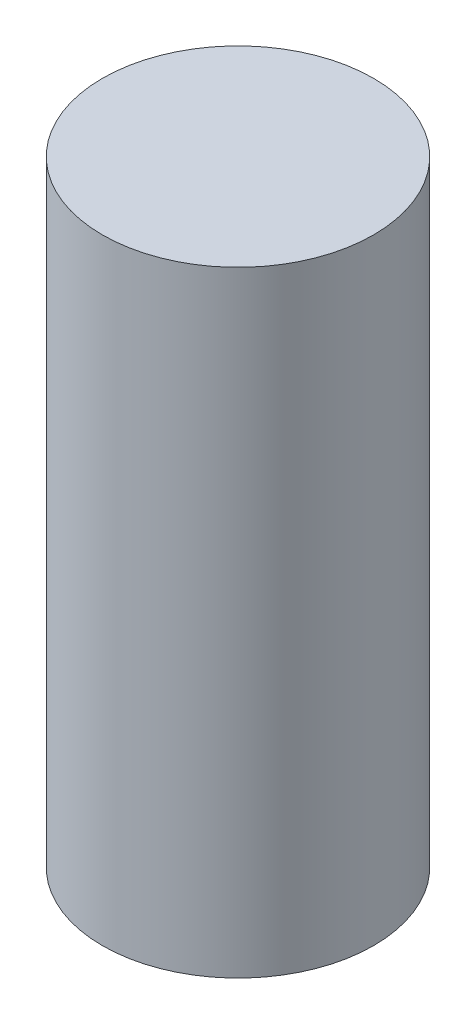
ISO-10303-21;
HEADER;
FILE_DESCRIPTION(('STEP AP214'),'2;1');
FILE_NAME('part.step','',(''),(''),'','','');
FILE_SCHEMA(('AUTOMOTIVE_DESIGN { 1 0 10303 214 1 1 1 1 }'));
ENDSEC;
DATA;
#1=APPLICATION_CONTEXT('core data for automotive mechanical design processes');
#2=APPLICATION_PROTOCOL_DEFINITION('international standard','automotive_design',2000,#1);
#3=PRODUCT_CONTEXT('',#1,'mechanical');
#4=PRODUCT('Part','Part','',(#3));
#5=PRODUCT_RELATED_PRODUCT_CATEGORY('part','',(#4));
#6=PRODUCT_DEFINITION_FORMATION('','',#4);
#7=PRODUCT_DEFINITION_CONTEXT('part definition',#1,'design');
#8=PRODUCT_DEFINITION('design','',#6,#7);
#9=PRODUCT_DEFINITION_SHAPE('','',#8);
#10=(LENGTH_UNIT() NAMED_UNIT(*) SI_UNIT(.MILLI.,.METRE.));
#11=(NAMED_UNIT(*) PLANE_ANGLE_UNIT() SI_UNIT($,.RADIAN.));
#12=(NAMED_UNIT(*) SI_UNIT($,.STERADIAN.) SOLID_ANGLE_UNIT());
#13=UNCERTAINTY_MEASURE_WITH_UNIT(LENGTH_MEASURE(1.E-05),#10,'distance_accuracy_value','');
#14=(GEOMETRIC_REPRESENTATION_CONTEXT(3) GLOBAL_UNCERTAINTY_ASSIGNED_CONTEXT((#13)) GLOBAL_UNIT_ASSIGNED_CONTEXT((#10,
#11,#12)) REPRESENTATION_CONTEXT('',''));
#15=CARTESIAN_POINT('',(0.,0.,0.));
#16=DIRECTION('',(0.,0.,1.));
#17=DIRECTION('',(1.,0.,0.));
#18=AXIS2_PLACEMENT_3D('',#15,#16,#17);
#19=CARTESIAN_POINT('',(0.,1282.7,0.));
#20=DIRECTION('',(0.,-1.,0.));
#21=DIRECTION('',(0.,0.,-1.));
#22=AXIS2_PLACEMENT_3D('',#19,#20,#21);
#23=CYLINDRICAL_SURFACE('',#22,282.575);
#24=CARTESIAN_POINT('',(0.,1282.7,0.));
#25=DIRECTION('',(0.,1.,0.));
#26=DIRECTION('',(0.,0.,1.));
#27=AXIS2_PLACEMENT_3D('',#24,#25,#26);
#28=CIRCLE('',#27,282.575);
#29=CARTESIAN_POINT('',(0.,1282.7,282.575));
#30=VERTEX_POINT('',#29);
#31=EDGE_CURVE('E10',#30,#30,#28,.T.);
#32=ORIENTED_EDGE('',*,*,#31,.F.);
#33=EDGE_LOOP('',(#32));
#34=FACE_BOUND('',#33,.T.);
#35=CARTESIAN_POINT('',(0.,0.,0.));
#36=DIRECTION('',(0.,1.,0.));
#37=DIRECTION('',(0.,0.,1.));
#38=AXIS2_PLACEMENT_3D('',#35,#36,#37);
#39=CIRCLE('',#38,282.575);
#40=CARTESIAN_POINT('',(0.,0.,282.575));
#41=VERTEX_POINT('',#40);
#42=EDGE_CURVE('E33',#41,#41,#39,.T.);
#43=ORIENTED_EDGE('',*,*,#42,.T.);
#44=EDGE_LOOP('',(#43));
#45=FACE_BOUND('',#44,.T.);
#46=ADVANCED_FACE('F30',(#34,#45),#23,.T.);
#47=CARTESIAN_POINT('',(0.,1282.7,0.));
#48=DIRECTION('',(0.,1.,0.));
#49=DIRECTION('',(0.,0.,1.));
#50=AXIS2_PLACEMENT_3D('',#47,#48,#49);
#51=PLANE('',#50);
#52=ORIENTED_EDGE('',*,*,#31,.T.);
#53=EDGE_LOOP('',(#52));
#54=FACE_BOUND('',#53,.T.);
#55=ADVANCED_FACE('F45',(#54),#51,.T.);
#56=CARTESIAN_POINT('',(0.,0.,0.));
#57=DIRECTION('',(0.,1.,0.));
#58=DIRECTION('',(0.,0.,1.));
#59=AXIS2_PLACEMENT_3D('',#56,#57,#58);
#60=PLANE('',#59);
#61=ORIENTED_EDGE('',*,*,#42,.F.);
#62=EDGE_LOOP('',(#61));
#63=FACE_BOUND('',#62,.T.);
#64=ADVANCED_FACE('F43',(#63),#60,.F.);
#65=CLOSED_SHELL('',(#46,#55,#64));
#66=MANIFOLD_SOLID_BREP('B2',#65);
#67=ADVANCED_BREP_SHAPE_REPRESENTATION('',(#18,#66),#14);
#68=SHAPE_DEFINITION_REPRESENTATION(#9,#67);
ENDSEC;
END-ISO-10303-21;
